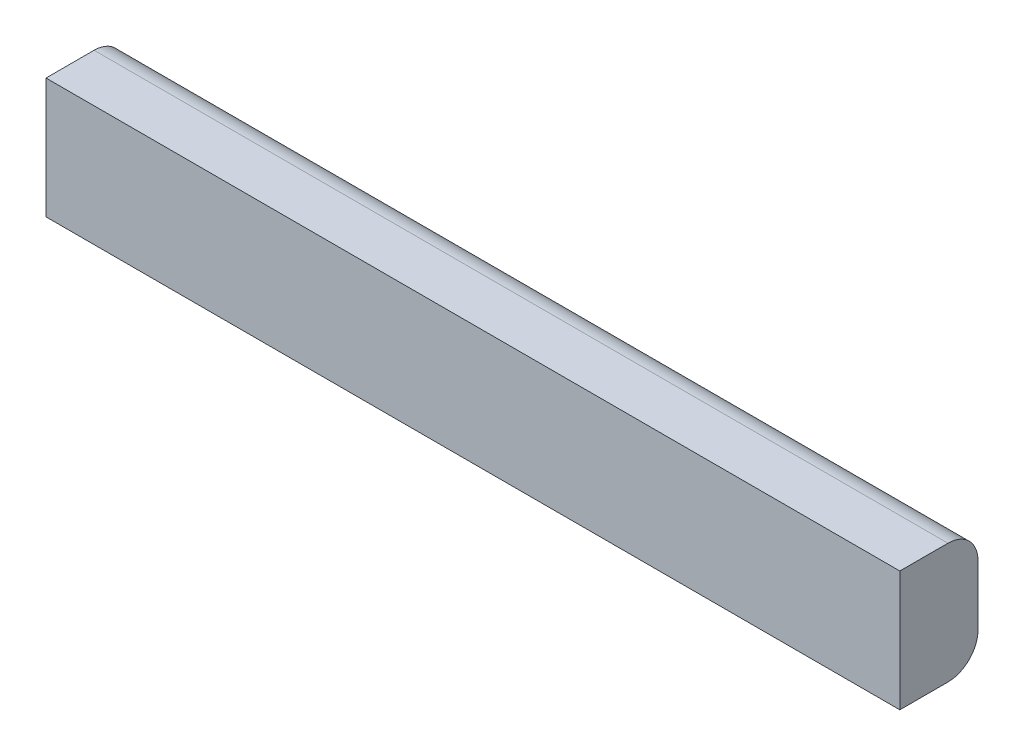
ISO-10303-21;
HEADER;
FILE_DESCRIPTION(('STEP AP214'),'2;1');
FILE_NAME('part.step','',(''),(''),'','','');
FILE_SCHEMA(('AUTOMOTIVE_DESIGN { 1 0 10303 214 1 1 1 1 }'));
ENDSEC;
DATA;
#1=APPLICATION_CONTEXT('core data for automotive mechanical design processes');
#2=APPLICATION_PROTOCOL_DEFINITION('international standard','automotive_design',2000,#1);
#3=PRODUCT_CONTEXT('',#1,'mechanical');
#4=PRODUCT('Part','Part','',(#3));
#5=PRODUCT_RELATED_PRODUCT_CATEGORY('part','',(#4));
#6=PRODUCT_DEFINITION_FORMATION('','',#4);
#7=PRODUCT_DEFINITION_CONTEXT('part definition',#1,'design');
#8=PRODUCT_DEFINITION('design','',#6,#7);
#9=PRODUCT_DEFINITION_SHAPE('','',#8);
#10=(LENGTH_UNIT() NAMED_UNIT(*) SI_UNIT(.MILLI.,.METRE.));
#11=(NAMED_UNIT(*) PLANE_ANGLE_UNIT() SI_UNIT($,.RADIAN.));
#12=(NAMED_UNIT(*) SI_UNIT($,.STERADIAN.) SOLID_ANGLE_UNIT());
#13=UNCERTAINTY_MEASURE_WITH_UNIT(LENGTH_MEASURE(1.E-05),#10,'distance_accuracy_value','');
#14=(GEOMETRIC_REPRESENTATION_CONTEXT(3) GLOBAL_UNCERTAINTY_ASSIGNED_CONTEXT((#13)) GLOBAL_UNIT_ASSIGNED_CONTEXT((#10,
#11,#12)) REPRESENTATION_CONTEXT('',''));
#15=CARTESIAN_POINT('',(0.,0.,0.));
#16=DIRECTION('',(0.,0.,1.));
#17=DIRECTION('',(1.,0.,0.));
#18=AXIS2_PLACEMENT_3D('',#15,#16,#17);
#19=CARTESIAN_POINT('',(450.85,66.0216606498195,1.42635379061369));
#20=DIRECTION('',(0.,0.,-1.));
#21=DIRECTION('',(0.,1.,0.));
#22=AXIS2_PLACEMENT_3D('',#19,#20,#21);
#23=PLANE('',#22);
#24=DIRECTION('',(0.,-1.,0.));
#25=VECTOR('',#24,1.);
#26=CARTESIAN_POINT('',(-450.85,66.0216606498195,1.42635379061369));
#27=LINE('',#26,#25);
#28=CARTESIAN_POINT('',(-450.85,66.0216606498195,1.42635379061369));
#29=VERTEX_POINT('',#28);
#30=CARTESIAN_POINT('',(-450.85,-60.9783393501805,1.42635379061368));
#31=VERTEX_POINT('',#30);
#32=EDGE_CURVE('E117',#29,#31,#27,.T.);
#33=ORIENTED_EDGE('',*,*,#32,.T.);
#34=DIRECTION('',(-1.,0.,0.));
#35=VECTOR('',#34,1.);
#36=CARTESIAN_POINT('',(450.85,-60.9783393501805,1.42635379061368));
#37=LINE('',#36,#35);
#38=CARTESIAN_POINT('',(450.85,-60.9783393501805,1.42635379061368));
#39=VERTEX_POINT('',#38);
#40=EDGE_CURVE('E11',#39,#31,#37,.T.);
#41=ORIENTED_EDGE('',*,*,#40,.F.);
#42=DIRECTION('',(0.,-1.,0.));
#43=VECTOR('',#42,1.);
#44=CARTESIAN_POINT('',(450.85,66.0216606498195,1.42635379061369));
#45=LINE('',#44,#43);
#46=CARTESIAN_POINT('',(450.85,66.0216606498195,1.42635379061369));
#47=VERTEX_POINT('',#46);
#48=EDGE_CURVE('E127',#47,#39,#45,.T.);
#49=ORIENTED_EDGE('',*,*,#48,.F.);
#50=DIRECTION('',(-1.,0.,0.));
#51=VECTOR('',#50,1.);
#52=CARTESIAN_POINT('',(450.85,66.0216606498195,1.42635379061369));
#53=LINE('',#52,#51);
#54=EDGE_CURVE('E113',#47,#29,#53,.T.);
#55=ORIENTED_EDGE('',*,*,#54,.T.);
#56=EDGE_LOOP('',(#33,#41,#49,#55));
#57=FACE_BOUND('',#56,.T.);
#58=ADVANCED_FACE('F33',(#57),#23,.F.);
#59=CARTESIAN_POINT('',(450.85,-60.9783393501805,-49.3736462093863));
#60=DIRECTION('',(0.,1.,0.));
#61=DIRECTION('',(0.,0.,1.));
#62=AXIS2_PLACEMENT_3D('',#59,#60,#61);
#63=PLANE('',#62);
#64=DIRECTION('',(0.,0.,-1.));
#65=VECTOR('',#64,1.);
#66=CARTESIAN_POINT('',(-450.85,-60.9783393501805,-49.3736462093863));
#67=LINE('',#66,#65);
#68=CARTESIAN_POINT('',(-450.85,-60.9783393501805,-49.3736462093863));
#69=VERTEX_POINT('',#68);
#70=EDGE_CURVE('E120',#31,#69,#67,.T.);
#71=ORIENTED_EDGE('',*,*,#70,.T.);
#72=DIRECTION('',(-1.,0.,0.));
#73=VECTOR('',#72,1.);
#74=CARTESIAN_POINT('',(450.85,-60.9783393501805,-49.3736462093863));
#75=LINE('',#74,#73);
#76=CARTESIAN_POINT('',(450.85,-60.9783393501805,-49.3736462093863));
#77=VERTEX_POINT('',#76);
#78=EDGE_CURVE('E41',#77,#69,#75,.T.);
#79=ORIENTED_EDGE('',*,*,#78,.F.);
#80=DIRECTION('',(0.,0.,-1.));
#81=VECTOR('',#80,1.);
#82=CARTESIAN_POINT('',(450.85,-60.9783393501805,-49.3736462093863));
#83=LINE('',#82,#81);
#84=EDGE_CURVE('E86',#39,#77,#83,.T.);
#85=ORIENTED_EDGE('',*,*,#84,.F.);
#86=ORIENTED_EDGE('',*,*,#40,.T.);
#87=EDGE_LOOP('',(#71,#79,#85,#86));
#88=FACE_BOUND('',#87,.T.);
#89=ADVANCED_FACE('F151',(#88),#63,.F.);
#90=CARTESIAN_POINT('',(450.85,-29.2283393501805,-49.3736462093863));
#91=DIRECTION('',(-1.,0.,0.));
#92=DIRECTION('',(0.,0.,1.));
#93=AXIS2_PLACEMENT_3D('',#90,#91,#92);
#94=CYLINDRICAL_SURFACE('',#93,31.75);
#95=CARTESIAN_POINT('',(-450.85,-29.2283393501805,-49.3736462093863));
#96=DIRECTION('',(1.,0.,0.));
#97=DIRECTION('',(0.,0.,1.));
#98=AXIS2_PLACEMENT_3D('',#95,#96,#97);
#99=CIRCLE('',#98,31.75);
#100=CARTESIAN_POINT('',(-450.85,-29.2283393501805,-81.1236462093863));
#101=VERTEX_POINT('',#100);
#102=EDGE_CURVE('E122',#69,#101,#99,.T.);
#103=ORIENTED_EDGE('',*,*,#102,.T.);
#104=DIRECTION('',(-1.,0.,0.));
#105=VECTOR('',#104,1.);
#106=CARTESIAN_POINT('',(450.85,-29.2283393501805,-81.1236462093863));
#107=LINE('',#106,#105);
#108=CARTESIAN_POINT('',(450.85,-29.2283393501805,-81.1236462093863));
#109=VERTEX_POINT('',#108);
#110=EDGE_CURVE('E108',#109,#101,#107,.T.);
#111=ORIENTED_EDGE('',*,*,#110,.F.);
#112=CARTESIAN_POINT('',(450.85,-29.2283393501805,-49.3736462093863));
#113=DIRECTION('',(1.,0.,0.));
#114=DIRECTION('',(0.,0.,1.));
#115=AXIS2_PLACEMENT_3D('',#112,#113,#114);
#116=CIRCLE('',#115,31.75);
#117=EDGE_CURVE('E99',#77,#109,#116,.T.);
#118=ORIENTED_EDGE('',*,*,#117,.F.);
#119=ORIENTED_EDGE('',*,*,#78,.T.);
#120=EDGE_LOOP('',(#103,#111,#118,#119));
#121=FACE_BOUND('',#120,.T.);
#122=ADVANCED_FACE('F133',(#121),#94,.T.);
#123=CARTESIAN_POINT('',(450.85,34.2716606498195,-81.1236462093863));
#124=DIRECTION('',(0.,0.,1.));
#125=DIRECTION('',(0.,-1.,0.));
#126=AXIS2_PLACEMENT_3D('',#123,#124,#125);
#127=PLANE('',#126);
#128=DIRECTION('',(0.,1.,0.));
#129=VECTOR('',#128,1.);
#130=CARTESIAN_POINT('',(-450.85,34.2716606498195,-81.1236462093863));
#131=LINE('',#130,#129);
#132=CARTESIAN_POINT('',(-450.85,34.2716606498195,-81.1236462093863));
#133=VERTEX_POINT('',#132);
#134=EDGE_CURVE('E107',#101,#133,#131,.T.);
#135=ORIENTED_EDGE('',*,*,#134,.T.);
#136=DIRECTION('',(-1.,0.,0.));
#137=VECTOR('',#136,1.);
#138=CARTESIAN_POINT('',(450.85,34.2716606498195,-81.1236462093863));
#139=LINE('',#138,#137);
#140=CARTESIAN_POINT('',(450.85,34.2716606498195,-81.1236462093863));
#141=VERTEX_POINT('',#140);
#142=EDGE_CURVE('E104',#141,#133,#139,.T.);
#143=ORIENTED_EDGE('',*,*,#142,.F.);
#144=DIRECTION('',(0.,1.,0.));
#145=VECTOR('',#144,1.);
#146=CARTESIAN_POINT('',(450.85,34.2716606498195,-81.1236462093863));
#147=LINE('',#146,#145);
#148=EDGE_CURVE('E93',#109,#141,#147,.T.);
#149=ORIENTED_EDGE('',*,*,#148,.F.);
#150=ORIENTED_EDGE('',*,*,#110,.T.);
#151=EDGE_LOOP('',(#135,#143,#149,#150));
#152=FACE_BOUND('',#151,.T.);
#153=ADVANCED_FACE('F105',(#152),#127,.F.);
#154=CARTESIAN_POINT('',(450.85,34.2716606498195,-49.3736462093863));
#155=DIRECTION('',(-1.,0.,0.));
#156=DIRECTION('',(0.,0.,1.));
#157=AXIS2_PLACEMENT_3D('',#154,#155,#156);
#158=CYLINDRICAL_SURFACE('',#157,31.75);
#159=CARTESIAN_POINT('',(-450.85,34.2716606498195,-49.3736462093863));
#160=DIRECTION('',(1.,0.,0.));
#161=DIRECTION('',(0.,0.,1.));
#162=AXIS2_PLACEMENT_3D('',#159,#160,#161);
#163=CIRCLE('',#162,31.75);
#164=CARTESIAN_POINT('',(-450.85,66.0216606498195,-49.3736462093862));
#165=VERTEX_POINT('',#164);
#166=EDGE_CURVE('E72',#133,#165,#163,.T.);
#167=ORIENTED_EDGE('',*,*,#166,.T.);
#168=DIRECTION('',(-1.,0.,0.));
#169=VECTOR('',#168,1.);
#170=CARTESIAN_POINT('',(450.85,66.0216606498195,-49.3736462093862));
#171=LINE('',#170,#169);
#172=CARTESIAN_POINT('',(450.85,66.0216606498195,-49.3736462093862));
#173=VERTEX_POINT('',#172);
#174=EDGE_CURVE('E109',#173,#165,#171,.T.);
#175=ORIENTED_EDGE('',*,*,#174,.F.);
#176=CARTESIAN_POINT('',(450.85,34.2716606498195,-49.3736462093863));
#177=DIRECTION('',(1.,0.,0.));
#178=DIRECTION('',(0.,0.,1.));
#179=AXIS2_PLACEMENT_3D('',#176,#177,#178);
#180=CIRCLE('',#179,31.75);
#181=EDGE_CURVE('E97',#141,#173,#180,.T.);
#182=ORIENTED_EDGE('',*,*,#181,.F.);
#183=ORIENTED_EDGE('',*,*,#142,.T.);
#184=EDGE_LOOP('',(#167,#175,#182,#183));
#185=FACE_BOUND('',#184,.T.);
#186=ADVANCED_FACE('F111',(#185),#158,.T.);
#187=CARTESIAN_POINT('',(450.85,66.0216606498195,-49.3736462093862));
#188=DIRECTION('',(0.,-1.,0.));
#189=DIRECTION('',(0.,0.,-1.));
#190=AXIS2_PLACEMENT_3D('',#187,#188,#189);
#191=PLANE('',#190);
#192=DIRECTION('',(0.,0.,1.));
#193=VECTOR('',#192,1.);
#194=CARTESIAN_POINT('',(-450.85,66.0216606498195,-49.3736462093862));
#195=LINE('',#194,#193);
#196=EDGE_CURVE('E78',#165,#29,#195,.T.);
#197=ORIENTED_EDGE('',*,*,#196,.T.);
#198=ORIENTED_EDGE('',*,*,#54,.F.);
#199=DIRECTION('',(0.,0.,1.));
#200=VECTOR('',#199,1.);
#201=CARTESIAN_POINT('',(450.85,66.0216606498195,-49.3736462093862));
#202=LINE('',#201,#200);
#203=EDGE_CURVE('E49',#173,#47,#202,.T.);
#204=ORIENTED_EDGE('',*,*,#203,.F.);
#205=ORIENTED_EDGE('',*,*,#174,.T.);
#206=EDGE_LOOP('',(#197,#198,#204,#205));
#207=FACE_BOUND('',#206,.T.);
#208=ADVANCED_FACE('F140',(#207),#191,.F.);
#209=CARTESIAN_POINT('',(450.85,-29.2283393501805,-49.3736462093863));
#210=DIRECTION('',(-1.,0.,0.));
#211=DIRECTION('',(0.,0.,1.));
#212=AXIS2_PLACEMENT_3D('',#209,#210,#211);
#213=PLANE('',#212);
#214=ORIENTED_EDGE('',*,*,#48,.T.);
#215=ORIENTED_EDGE('',*,*,#84,.T.);
#216=ORIENTED_EDGE('',*,*,#117,.T.);
#217=ORIENTED_EDGE('',*,*,#148,.T.);
#218=ORIENTED_EDGE('',*,*,#181,.T.);
#219=ORIENTED_EDGE('',*,*,#203,.T.);
#220=EDGE_LOOP('',(#214,#215,#216,#217,#218,#219));
#221=FACE_BOUND('',#220,.T.);
#222=ADVANCED_FACE('F95',(#221),#213,.F.);
#223=CARTESIAN_POINT('',(-450.85,-29.2283393501805,-49.3736462093863));
#224=DIRECTION('',(-1.,0.,0.));
#225=DIRECTION('',(0.,0.,1.));
#226=AXIS2_PLACEMENT_3D('',#223,#224,#225);
#227=PLANE('',#226);
#228=ORIENTED_EDGE('',*,*,#32,.F.);
#229=ORIENTED_EDGE('',*,*,#196,.F.);
#230=ORIENTED_EDGE('',*,*,#166,.F.);
#231=ORIENTED_EDGE('',*,*,#134,.F.);
#232=ORIENTED_EDGE('',*,*,#102,.F.);
#233=ORIENTED_EDGE('',*,*,#70,.F.);
#234=EDGE_LOOP('',(#228,#229,#230,#231,#232,#233));
#235=FACE_BOUND('',#234,.T.);
#236=ADVANCED_FACE('F136',(#235),#227,.T.);
#237=CLOSED_SHELL('',(#58,#89,#122,#153,#186,#208,#222,#236));
#238=MANIFOLD_SOLID_BREP('B2',#237);
#239=ADVANCED_BREP_SHAPE_REPRESENTATION('',(#18,#238),#14);
#240=SHAPE_DEFINITION_REPRESENTATION(#9,#239);
ENDSEC;
END-ISO-10303-21;
